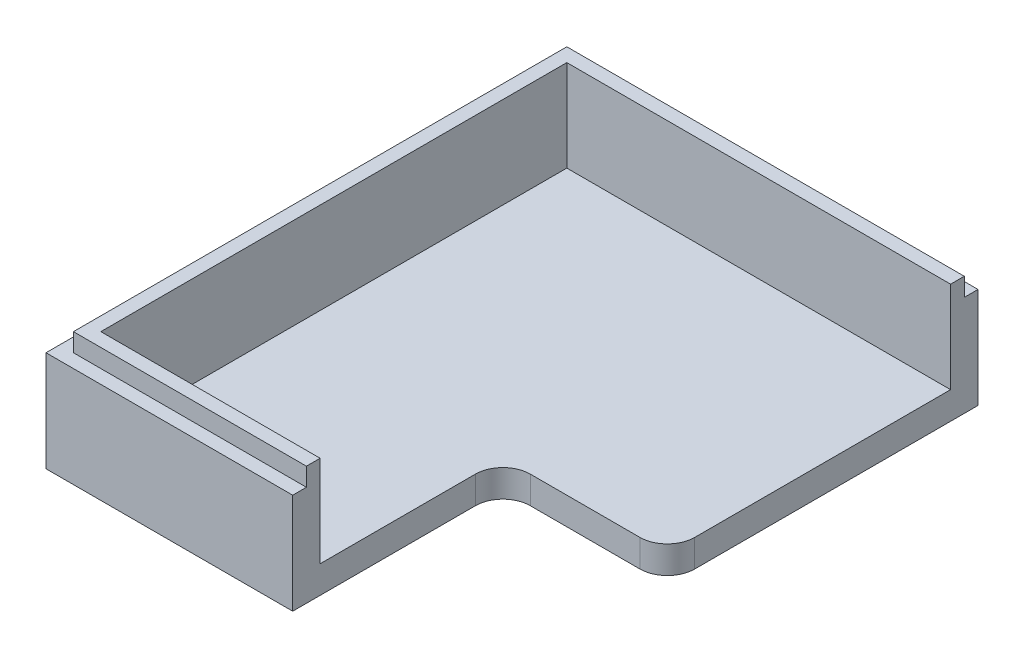
ISO-10303-21;
HEADER;
FILE_DESCRIPTION(('STEP AP214'),'2;1');
FILE_NAME('part.step','',(''),(''),'','','');
FILE_SCHEMA(('AUTOMOTIVE_DESIGN { 1 0 10303 214 1 1 1 1 }'));
ENDSEC;
DATA;
#1=APPLICATION_CONTEXT('core data for automotive mechanical design processes');
#2=APPLICATION_PROTOCOL_DEFINITION('international standard','automotive_design',2000,#1);
#3=PRODUCT_CONTEXT('',#1,'mechanical');
#4=PRODUCT('Part','Part','',(#3));
#5=PRODUCT_RELATED_PRODUCT_CATEGORY('part','',(#4));
#6=PRODUCT_DEFINITION_FORMATION('','',#4);
#7=PRODUCT_DEFINITION_CONTEXT('part definition',#1,'design');
#8=PRODUCT_DEFINITION('design','',#6,#7);
#9=PRODUCT_DEFINITION_SHAPE('','',#8);
#10=(LENGTH_UNIT() NAMED_UNIT(*) SI_UNIT(.MILLI.,.METRE.));
#11=(NAMED_UNIT(*) PLANE_ANGLE_UNIT() SI_UNIT($,.RADIAN.));
#12=(NAMED_UNIT(*) SI_UNIT($,.STERADIAN.) SOLID_ANGLE_UNIT());
#13=UNCERTAINTY_MEASURE_WITH_UNIT(LENGTH_MEASURE(1.E-05),#10,'distance_accuracy_value','');
#14=(GEOMETRIC_REPRESENTATION_CONTEXT(3) GLOBAL_UNCERTAINTY_ASSIGNED_CONTEXT((#13)) GLOBAL_UNIT_ASSIGNED_CONTEXT((#10,
#11,#12)) REPRESENTATION_CONTEXT('',''));
#15=CARTESIAN_POINT('',(0.,0.,0.));
#16=DIRECTION('',(0.,0.,1.));
#17=DIRECTION('',(1.,0.,0.));
#18=AXIS2_PLACEMENT_3D('',#15,#16,#17);
#19=CARTESIAN_POINT('',(0.,11.,0.));
#20=DIRECTION('',(0.,1.,0.));
#21=DIRECTION('',(0.,0.,1.));
#22=AXIS2_PLACEMENT_3D('',#19,#20,#21);
#23=PLANE('',#22);
#24=DIRECTION('',(0.,0.,1.));
#25=VECTOR('',#24,1.);
#26=CARTESIAN_POINT('',(-8.49999999999999,11.,0.));
#27=LINE('',#26,#25);
#28=CARTESIAN_POINT('',(-8.49999999999999,11.,27.));
#29=VERTEX_POINT('',#28);
#30=CARTESIAN_POINT('',(-8.49999999999999,11.,28.5));
#31=VERTEX_POINT('',#30);
#32=EDGE_CURVE('E154',#29,#31,#27,.T.);
#33=ORIENTED_EDGE('',*,*,#32,.F.);
#34=DIRECTION('',(1.,0.,0.));
#35=VECTOR('',#34,1.);
#36=CARTESIAN_POINT('',(-34.,11.,27.));
#37=LINE('',#36,#35);
#38=CARTESIAN_POINT('',(-34.,11.,27.));
#39=VERTEX_POINT('',#38);
#40=EDGE_CURVE('E239',#39,#29,#37,.T.);
#41=ORIENTED_EDGE('',*,*,#40,.F.);
#42=DIRECTION('',(0.,0.,1.));
#43=VECTOR('',#42,1.);
#44=CARTESIAN_POINT('',(-34.,11.,-27.));
#45=LINE('',#44,#43);
#46=CARTESIAN_POINT('',(-34.,11.,-27.));
#47=VERTEX_POINT('',#46);
#48=EDGE_CURVE('E246',#47,#39,#45,.T.);
#49=ORIENTED_EDGE('',*,*,#48,.F.);
#50=DIRECTION('',(-1.,0.,0.));
#51=VECTOR('',#50,1.);
#52=CARTESIAN_POINT('',(34.,11.,-27.));
#53=LINE('',#52,#51);
#54=CARTESIAN_POINT('',(9.50000000000001,11.,-27.));
#55=VERTEX_POINT('',#54);
#56=EDGE_CURVE('E235',#55,#47,#53,.T.);
#57=ORIENTED_EDGE('',*,*,#56,.F.);
#58=DIRECTION('',(0.,0.,1.));
#59=VECTOR('',#58,1.);
#60=CARTESIAN_POINT('',(9.50000000000001,11.,0.));
#61=LINE('',#60,#59);
#62=CARTESIAN_POINT('',(9.50000000000001,11.,-28.5));
#63=VERTEX_POINT('',#62);
#64=EDGE_CURVE('E224',#63,#55,#61,.T.);
#65=ORIENTED_EDGE('',*,*,#64,.F.);
#66=DIRECTION('',(-1.,0.,0.));
#67=VECTOR('',#66,1.);
#68=CARTESIAN_POINT('',(35.5,11.,-28.5));
#69=LINE('',#68,#67);
#70=CARTESIAN_POINT('',(-35.5,11.,-28.5));
#71=VERTEX_POINT('',#70);
#72=EDGE_CURVE('E268',#63,#71,#69,.T.);
#73=ORIENTED_EDGE('',*,*,#72,.T.);
#74=DIRECTION('',(0.,0.,1.));
#75=VECTOR('',#74,1.);
#76=CARTESIAN_POINT('',(-35.5,11.,-28.5));
#77=LINE('',#76,#75);
#78=CARTESIAN_POINT('',(-35.5,11.,28.5));
#79=VERTEX_POINT('',#78);
#80=EDGE_CURVE('E270',#71,#79,#77,.T.);
#81=ORIENTED_EDGE('',*,*,#80,.T.);
#82=DIRECTION('',(1.,0.,0.));
#83=VECTOR('',#82,1.);
#84=CARTESIAN_POINT('',(-35.5,11.,28.5));
#85=LINE('',#84,#83);
#86=EDGE_CURVE('E179',#79,#31,#85,.T.);
#87=ORIENTED_EDGE('',*,*,#86,.T.);
#88=EDGE_LOOP('',(#33,#41,#49,#57,#65,#73,#81,#87));
#89=FACE_BOUND('',#88,.T.);
#90=ADVANCED_FACE('F33',(#89),#23,.T.);
#91=CARTESIAN_POINT('',(-35.5,3.,-28.5));
#92=DIRECTION('',(1.,0.,0.));
#93=DIRECTION('',(0.,0.,-1.));
#94=AXIS2_PLACEMENT_3D('',#91,#92,#93);
#95=PLANE('',#94);
#96=DIRECTION('',(0.,0.,1.));
#97=VECTOR('',#96,1.);
#98=CARTESIAN_POINT('',(-35.5,0.,-28.5));
#99=LINE('',#98,#97);
#100=CARTESIAN_POINT('',(-35.5,0.,-28.5));
#101=VERTEX_POINT('',#100);
#102=CARTESIAN_POINT('',(-35.5,0.,28.5));
#103=VERTEX_POINT('',#102);
#104=EDGE_CURVE('E175',#101,#103,#99,.T.);
#105=ORIENTED_EDGE('',*,*,#104,.T.);
#106=DIRECTION('',(0.,-1.,0.));
#107=VECTOR('',#106,1.);
#108=CARTESIAN_POINT('',(-35.5,3.,28.5));
#109=LINE('',#108,#107);
#110=EDGE_CURVE('E172',#79,#103,#109,.T.);
#111=ORIENTED_EDGE('',*,*,#110,.F.);
#112=ORIENTED_EDGE('',*,*,#80,.F.);
#113=DIRECTION('',(0.,-1.,0.));
#114=VECTOR('',#113,1.);
#115=CARTESIAN_POINT('',(-35.5,3.,-28.5));
#116=LINE('',#115,#114);
#117=EDGE_CURVE('E177',#71,#101,#116,.T.);
#118=ORIENTED_EDGE('',*,*,#117,.T.);
#119=EDGE_LOOP('',(#105,#111,#112,#118));
#120=FACE_BOUND('',#119,.T.);
#121=ADVANCED_FACE('F279',(#120),#95,.F.);
#122=CARTESIAN_POINT('',(-35.5,3.,28.5));
#123=DIRECTION('',(0.,0.,-1.));
#124=DIRECTION('',(-1.,0.,0.));
#125=AXIS2_PLACEMENT_3D('',#122,#123,#124);
#126=PLANE('',#125);
#127=DIRECTION('',(1.,0.,0.));
#128=VECTOR('',#127,1.);
#129=CARTESIAN_POINT('',(-35.5,0.,28.5));
#130=LINE('',#129,#128);
#131=CARTESIAN_POINT('',(-8.49999999999999,0.,28.5));
#132=VERTEX_POINT('',#131);
#133=EDGE_CURVE('E166',#103,#132,#130,.T.);
#134=ORIENTED_EDGE('',*,*,#133,.T.);
#135=DIRECTION('',(0.,-1.,0.));
#136=VECTOR('',#135,1.);
#137=CARTESIAN_POINT('',(-8.49999999999999,13.,28.5));
#138=LINE('',#137,#136);
#139=EDGE_CURVE('E148',#31,#132,#138,.T.);
#140=ORIENTED_EDGE('',*,*,#139,.F.);
#141=ORIENTED_EDGE('',*,*,#86,.F.);
#142=ORIENTED_EDGE('',*,*,#110,.T.);
#143=EDGE_LOOP('',(#134,#140,#141,#142));
#144=FACE_BOUND('',#143,.T.);
#145=ADVANCED_FACE('F171',(#144),#126,.F.);
#146=CARTESIAN_POINT('',(-35.5,3.,-28.5));
#147=DIRECTION('',(0.,0.,1.));
#148=DIRECTION('',(1.,0.,0.));
#149=AXIS2_PLACEMENT_3D('',#146,#147,#148);
#150=PLANE('',#149);
#151=ORIENTED_EDGE('',*,*,#72,.F.);
#152=DIRECTION('',(0.,1.,0.));
#153=VECTOR('',#152,1.);
#154=CARTESIAN_POINT('',(9.50000000000001,14.9779468060906,-28.5));
#155=LINE('',#154,#153);
#156=CARTESIAN_POINT('',(9.50000000000001,0.,-28.5));
#157=VERTEX_POINT('',#156);
#158=EDGE_CURVE('E215',#157,#63,#155,.T.);
#159=ORIENTED_EDGE('',*,*,#158,.F.);
#160=DIRECTION('',(-1.,0.,0.));
#161=VECTOR('',#160,1.);
#162=CARTESIAN_POINT('',(-35.5,0.,-28.5));
#163=LINE('',#162,#161);
#164=EDGE_CURVE('E174',#157,#101,#163,.T.);
#165=ORIENTED_EDGE('',*,*,#164,.T.);
#166=ORIENTED_EDGE('',*,*,#117,.F.);
#167=EDGE_LOOP('',(#151,#159,#165,#166));
#168=FACE_BOUND('',#167,.T.);
#169=ADVANCED_FACE('F281',(#168),#150,.F.);
#170=CARTESIAN_POINT('',(0.,0.,0.));
#171=DIRECTION('',(0.,1.,0.));
#172=DIRECTION('',(0.,0.,1.));
#173=AXIS2_PLACEMENT_3D('',#170,#171,#172);
#174=PLANE('',#173);
#175=DIRECTION('',(0.,0.,1.));
#176=VECTOR('',#175,1.);
#177=CARTESIAN_POINT('',(9.50000000000001,0.,0.));
#178=LINE('',#177,#176);
#179=CARTESIAN_POINT('',(9.50000000000001,0.,2.5));
#180=VERTEX_POINT('',#179);
#181=EDGE_CURVE('E202',#157,#180,#178,.T.);
#182=ORIENTED_EDGE('',*,*,#181,.T.);
#183=CARTESIAN_POINT('',(6.50000000000001,0.,2.5));
#184=DIRECTION('',(0.,1.,0.));
#185=DIRECTION('',(0.,0.,1.));
#186=AXIS2_PLACEMENT_3D('',#183,#184,#185);
#187=CIRCLE('',#186,3.);
#188=CARTESIAN_POINT('',(6.50000000000001,0.,5.5));
#189=VERTEX_POINT('',#188);
#190=EDGE_CURVE('E48',#180,#189,#187,.F.);
#191=ORIENTED_EDGE('',*,*,#190,.T.);
#192=DIRECTION('',(1.,0.,0.));
#193=VECTOR('',#192,1.);
#194=CARTESIAN_POINT('',(35.5,0.,5.50000000000001));
#195=LINE('',#194,#193);
#196=CARTESIAN_POINT('',(-5.49999999999998,0.,5.5));
#197=VERTEX_POINT('',#196);
#198=EDGE_CURVE('E169',#197,#189,#195,.T.);
#199=ORIENTED_EDGE('',*,*,#198,.F.);
#200=CARTESIAN_POINT('',(-5.49999999999998,0.,8.5));
#201=DIRECTION('',(0.,1.,0.));
#202=DIRECTION('',(0.,0.,1.));
#203=AXIS2_PLACEMENT_3D('',#200,#201,#202);
#204=CIRCLE('',#203,3.);
#205=CARTESIAN_POINT('',(-8.49999999999999,0.,8.5));
#206=VERTEX_POINT('',#205);
#207=EDGE_CURVE('E41',#197,#206,#204,.T.);
#208=ORIENTED_EDGE('',*,*,#207,.T.);
#209=DIRECTION('',(0.,0.,-1.));
#210=VECTOR('',#209,1.);
#211=CARTESIAN_POINT('',(-8.49999999999999,0.,28.5));
#212=LINE('',#211,#210);
#213=EDGE_CURVE('E151',#132,#206,#212,.T.);
#214=ORIENTED_EDGE('',*,*,#213,.F.);
#215=ORIENTED_EDGE('',*,*,#133,.F.);
#216=ORIENTED_EDGE('',*,*,#104,.F.);
#217=ORIENTED_EDGE('',*,*,#164,.F.);
#218=EDGE_LOOP('',(#182,#191,#199,#208,#214,#215,#216,#217));
#219=FACE_BOUND('',#218,.T.);
#220=ADVANCED_FACE('F164',(#219),#174,.F.);
#221=CARTESIAN_POINT('',(0.,13.,0.));
#222=DIRECTION('',(0.,1.,0.));
#223=DIRECTION('',(0.,0.,1.));
#224=AXIS2_PLACEMENT_3D('',#221,#222,#223);
#225=PLANE('',#224);
#226=DIRECTION('',(0.,0.,-1.));
#227=VECTOR('',#226,1.);
#228=CARTESIAN_POINT('',(-8.49999999999999,13.,28.5));
#229=LINE('',#228,#227);
#230=CARTESIAN_POINT('',(-8.49999999999999,13.,27.));
#231=VERTEX_POINT('',#230);
#232=CARTESIAN_POINT('',(-8.49999999999999,13.,25.5));
#233=VERTEX_POINT('',#232);
#234=EDGE_CURVE('E160',#231,#233,#229,.T.);
#235=ORIENTED_EDGE('',*,*,#234,.T.);
#236=DIRECTION('',(1.,0.,0.));
#237=VECTOR('',#236,1.);
#238=CARTESIAN_POINT('',(-32.5,13.,25.5));
#239=LINE('',#238,#237);
#240=CARTESIAN_POINT('',(-32.5,13.,25.5));
#241=VERTEX_POINT('',#240);
#242=EDGE_CURVE('E227',#241,#233,#239,.T.);
#243=ORIENTED_EDGE('',*,*,#242,.F.);
#244=DIRECTION('',(0.,0.,1.));
#245=VECTOR('',#244,1.);
#246=CARTESIAN_POINT('',(-32.5,13.,-25.5));
#247=LINE('',#246,#245);
#248=CARTESIAN_POINT('',(-32.5,13.,-25.5));
#249=VERTEX_POINT('',#248);
#250=EDGE_CURVE('E232',#249,#241,#247,.T.);
#251=ORIENTED_EDGE('',*,*,#250,.F.);
#252=DIRECTION('',(-1.,0.,0.));
#253=VECTOR('',#252,1.);
#254=CARTESIAN_POINT('',(32.5,13.,-25.5));
#255=LINE('',#254,#253);
#256=CARTESIAN_POINT('',(9.50000000000001,13.,-25.5));
#257=VERTEX_POINT('',#256);
#258=EDGE_CURVE('E230',#257,#249,#255,.T.);
#259=ORIENTED_EDGE('',*,*,#258,.F.);
#260=DIRECTION('',(0.,0.,1.));
#261=VECTOR('',#260,1.);
#262=CARTESIAN_POINT('',(9.50000000000001,13.,0.));
#263=LINE('',#262,#261);
#264=CARTESIAN_POINT('',(9.50000000000001,13.,-27.));
#265=VERTEX_POINT('',#264);
#266=EDGE_CURVE('E214',#265,#257,#263,.T.);
#267=ORIENTED_EDGE('',*,*,#266,.F.);
#268=DIRECTION('',(-1.,0.,0.));
#269=VECTOR('',#268,1.);
#270=CARTESIAN_POINT('',(34.,13.,-27.));
#271=LINE('',#270,#269);
#272=CARTESIAN_POINT('',(-34.,13.,-27.));
#273=VERTEX_POINT('',#272);
#274=EDGE_CURVE('E236',#265,#273,#271,.T.);
#275=ORIENTED_EDGE('',*,*,#274,.T.);
#276=DIRECTION('',(0.,0.,1.));
#277=VECTOR('',#276,1.);
#278=CARTESIAN_POINT('',(-34.,13.,-27.));
#279=LINE('',#278,#277);
#280=CARTESIAN_POINT('',(-34.,13.,27.));
#281=VERTEX_POINT('',#280);
#282=EDGE_CURVE('E238',#273,#281,#279,.T.);
#283=ORIENTED_EDGE('',*,*,#282,.T.);
#284=DIRECTION('',(1.,0.,0.));
#285=VECTOR('',#284,1.);
#286=CARTESIAN_POINT('',(-34.,13.,27.));
#287=LINE('',#286,#285);
#288=EDGE_CURVE('E241',#281,#231,#287,.T.);
#289=ORIENTED_EDGE('',*,*,#288,.T.);
#290=EDGE_LOOP('',(#235,#243,#251,#259,#267,#275,#283,#289));
#291=FACE_BOUND('',#290,.T.);
#292=ADVANCED_FACE('F295',(#291),#225,.T.);
#293=CARTESIAN_POINT('',(34.,13.,-27.));
#294=DIRECTION('',(0.,0.,1.));
#295=DIRECTION('',(1.,0.,0.));
#296=AXIS2_PLACEMENT_3D('',#293,#294,#295);
#297=PLANE('',#296);
#298=ORIENTED_EDGE('',*,*,#274,.F.);
#299=DIRECTION('',(0.,-1.,0.));
#300=VECTOR('',#299,1.);
#301=CARTESIAN_POINT('',(9.50000000000001,13.,-27.));
#302=LINE('',#301,#300);
#303=EDGE_CURVE('E217',#265,#55,#302,.T.);
#304=ORIENTED_EDGE('',*,*,#303,.T.);
#305=ORIENTED_EDGE('',*,*,#56,.T.);
#306=DIRECTION('',(0.,-1.,0.));
#307=VECTOR('',#306,1.);
#308=CARTESIAN_POINT('',(-34.,13.,-27.));
#309=LINE('',#308,#307);
#310=EDGE_CURVE('E252',#273,#47,#309,.T.);
#311=ORIENTED_EDGE('',*,*,#310,.F.);
#312=EDGE_LOOP('',(#298,#304,#305,#311));
#313=FACE_BOUND('',#312,.T.);
#314=ADVANCED_FACE('F287',(#313),#297,.F.);
#315=CARTESIAN_POINT('',(-34.,13.,-27.));
#316=DIRECTION('',(1.,0.,0.));
#317=DIRECTION('',(0.,0.,-1.));
#318=AXIS2_PLACEMENT_3D('',#315,#316,#317);
#319=PLANE('',#318);
#320=ORIENTED_EDGE('',*,*,#48,.T.);
#321=DIRECTION('',(0.,-1.,0.));
#322=VECTOR('',#321,1.);
#323=CARTESIAN_POINT('',(-34.,13.,27.));
#324=LINE('',#323,#322);
#325=EDGE_CURVE('E244',#281,#39,#324,.T.);
#326=ORIENTED_EDGE('',*,*,#325,.F.);
#327=ORIENTED_EDGE('',*,*,#282,.F.);
#328=ORIENTED_EDGE('',*,*,#310,.T.);
#329=EDGE_LOOP('',(#320,#326,#327,#328));
#330=FACE_BOUND('',#329,.T.);
#331=ADVANCED_FACE('F290',(#330),#319,.F.);
#332=CARTESIAN_POINT('',(-34.,13.,27.));
#333=DIRECTION('',(0.,0.,-1.));
#334=DIRECTION('',(-1.,0.,0.));
#335=AXIS2_PLACEMENT_3D('',#332,#333,#334);
#336=PLANE('',#335);
#337=ORIENTED_EDGE('',*,*,#40,.T.);
#338=DIRECTION('',(0.,1.,0.));
#339=VECTOR('',#338,1.);
#340=CARTESIAN_POINT('',(-8.49999999999999,13.,27.));
#341=LINE('',#340,#339);
#342=EDGE_CURVE('E314',#29,#231,#341,.T.);
#343=ORIENTED_EDGE('',*,*,#342,.T.);
#344=ORIENTED_EDGE('',*,*,#288,.F.);
#345=ORIENTED_EDGE('',*,*,#325,.T.);
#346=EDGE_LOOP('',(#337,#343,#344,#345));
#347=FACE_BOUND('',#346,.T.);
#348=ADVANCED_FACE('F335',(#347),#336,.F.);
#349=CARTESIAN_POINT('',(0.,3.,0.));
#350=DIRECTION('',(0.,1.,0.));
#351=DIRECTION('',(0.,0.,1.));
#352=AXIS2_PLACEMENT_3D('',#349,#350,#351);
#353=PLANE('',#352);
#354=DIRECTION('',(-1.,0.,0.));
#355=VECTOR('',#354,1.);
#356=CARTESIAN_POINT('',(0.,3.,5.5));
#357=LINE('',#356,#355);
#358=CARTESIAN_POINT('',(6.50000000000001,3.,5.5));
#359=VERTEX_POINT('',#358);
#360=CARTESIAN_POINT('',(-5.49999999999998,3.,5.5));
#361=VERTEX_POINT('',#360);
#362=EDGE_CURVE('E159',#359,#361,#357,.T.);
#363=ORIENTED_EDGE('',*,*,#362,.F.);
#364=CARTESIAN_POINT('',(6.50000000000001,3.,2.5));
#365=DIRECTION('',(0.,1.,0.));
#366=DIRECTION('',(0.,0.,1.));
#367=AXIS2_PLACEMENT_3D('',#364,#365,#366);
#368=CIRCLE('',#367,3.);
#369=CARTESIAN_POINT('',(9.50000000000001,3.,2.5));
#370=VERTEX_POINT('',#369);
#371=EDGE_CURVE('E56',#359,#370,#368,.T.);
#372=ORIENTED_EDGE('',*,*,#371,.T.);
#373=DIRECTION('',(0.,0.,1.));
#374=VECTOR('',#373,1.);
#375=CARTESIAN_POINT('',(9.50000000000001,3.,0.));
#376=LINE('',#375,#374);
#377=CARTESIAN_POINT('',(9.50000000000001,3.,-25.5));
#378=VERTEX_POINT('',#377);
#379=EDGE_CURVE('E211',#378,#370,#376,.T.);
#380=ORIENTED_EDGE('',*,*,#379,.F.);
#381=DIRECTION('',(-1.,0.,0.));
#382=VECTOR('',#381,1.);
#383=CARTESIAN_POINT('',(32.5,3.,-25.5));
#384=LINE('',#383,#382);
#385=CARTESIAN_POINT('',(-32.5,3.,-25.5));
#386=VERTEX_POINT('',#385);
#387=EDGE_CURVE('E255',#378,#386,#384,.T.);
#388=ORIENTED_EDGE('',*,*,#387,.T.);
#389=DIRECTION('',(0.,0.,1.));
#390=VECTOR('',#389,1.);
#391=CARTESIAN_POINT('',(-32.5,3.,-25.5));
#392=LINE('',#391,#390);
#393=CARTESIAN_POINT('',(-32.5,3.,25.5));
#394=VERTEX_POINT('',#393);
#395=EDGE_CURVE('E257',#386,#394,#392,.T.);
#396=ORIENTED_EDGE('',*,*,#395,.T.);
#397=DIRECTION('',(1.,0.,0.));
#398=VECTOR('',#397,1.);
#399=CARTESIAN_POINT('',(-32.5,3.,25.5));
#400=LINE('',#399,#398);
#401=CARTESIAN_POINT('',(-8.49999999999999,3.,25.5));
#402=VERTEX_POINT('',#401);
#403=EDGE_CURVE('E259',#394,#402,#400,.T.);
#404=ORIENTED_EDGE('',*,*,#403,.T.);
#405=DIRECTION('',(0.,0.,1.));
#406=VECTOR('',#405,1.);
#407=CARTESIAN_POINT('',(-8.49999999999999,3.,0.));
#408=LINE('',#407,#406);
#409=CARTESIAN_POINT('',(-8.49999999999999,3.,8.5));
#410=VERTEX_POINT('',#409);
#411=EDGE_CURVE('E312',#410,#402,#408,.T.);
#412=ORIENTED_EDGE('',*,*,#411,.F.);
#413=CARTESIAN_POINT('',(-5.49999999999998,3.,8.5));
#414=DIRECTION('',(0.,1.,0.));
#415=DIRECTION('',(0.,0.,1.));
#416=AXIS2_PLACEMENT_3D('',#413,#414,#415);
#417=CIRCLE('',#416,3.);
#418=EDGE_CURVE('E11',#410,#361,#417,.F.);
#419=ORIENTED_EDGE('',*,*,#418,.T.);
#420=EDGE_LOOP('',(#363,#372,#380,#388,#396,#404,#412,#419));
#421=FACE_BOUND('',#420,.T.);
#422=ADVANCED_FACE('F303',(#421),#353,.T.);
#423=CARTESIAN_POINT('',(-32.5,11.,25.5));
#424=DIRECTION('',(0.,0.,-1.));
#425=DIRECTION('',(-1.,0.,0.));
#426=AXIS2_PLACEMENT_3D('',#423,#424,#425);
#427=PLANE('',#426);
#428=DIRECTION('',(0.,1.,0.));
#429=VECTOR('',#428,1.);
#430=CARTESIAN_POINT('',(-8.49999999999999,11.,25.5));
#431=LINE('',#430,#429);
#432=EDGE_CURVE('E188',#402,#233,#431,.T.);
#433=ORIENTED_EDGE('',*,*,#432,.F.);
#434=ORIENTED_EDGE('',*,*,#403,.F.);
#435=DIRECTION('',(0.,-1.,0.));
#436=VECTOR('',#435,1.);
#437=CARTESIAN_POINT('',(-32.5,11.,25.5));
#438=LINE('',#437,#436);
#439=EDGE_CURVE('E262',#241,#394,#438,.T.);
#440=ORIENTED_EDGE('',*,*,#439,.F.);
#441=ORIENTED_EDGE('',*,*,#242,.T.);
#442=EDGE_LOOP('',(#433,#434,#440,#441));
#443=FACE_BOUND('',#442,.T.);
#444=ADVANCED_FACE('F310',(#443),#427,.T.);
#445=CARTESIAN_POINT('',(-32.5,11.,-25.5));
#446=DIRECTION('',(1.,0.,0.));
#447=DIRECTION('',(0.,0.,-1.));
#448=AXIS2_PLACEMENT_3D('',#445,#446,#447);
#449=PLANE('',#448);
#450=ORIENTED_EDGE('',*,*,#395,.F.);
#451=DIRECTION('',(0.,-1.,0.));
#452=VECTOR('',#451,1.);
#453=CARTESIAN_POINT('',(-32.5,11.,-25.5));
#454=LINE('',#453,#452);
#455=EDGE_CURVE('E265',#249,#386,#454,.T.);
#456=ORIENTED_EDGE('',*,*,#455,.F.);
#457=ORIENTED_EDGE('',*,*,#250,.T.);
#458=ORIENTED_EDGE('',*,*,#439,.T.);
#459=EDGE_LOOP('',(#450,#456,#457,#458));
#460=FACE_BOUND('',#459,.T.);
#461=ADVANCED_FACE('F305',(#460),#449,.T.);
#462=CARTESIAN_POINT('',(32.5,11.,-25.5));
#463=DIRECTION('',(0.,0.,1.));
#464=DIRECTION('',(1.,0.,0.));
#465=AXIS2_PLACEMENT_3D('',#462,#463,#464);
#466=PLANE('',#465);
#467=DIRECTION('',(0.,-1.,0.));
#468=VECTOR('',#467,1.);
#469=CARTESIAN_POINT('',(9.50000000000001,11.,-25.5));
#470=LINE('',#469,#468);
#471=EDGE_CURVE('E186',#257,#378,#470,.T.);
#472=ORIENTED_EDGE('',*,*,#471,.F.);
#473=ORIENTED_EDGE('',*,*,#258,.T.);
#474=ORIENTED_EDGE('',*,*,#455,.T.);
#475=ORIENTED_EDGE('',*,*,#387,.F.);
#476=EDGE_LOOP('',(#472,#473,#474,#475));
#477=FACE_BOUND('',#476,.T.);
#478=ADVANCED_FACE('F300',(#477),#466,.T.);
#479=CARTESIAN_POINT('',(9.50000000000001,14.9779468060906,28.5));
#480=DIRECTION('',(-1.,0.,0.));
#481=DIRECTION('',(0.,-1.,0.));
#482=AXIS2_PLACEMENT_3D('',#479,#480,#481);
#483=PLANE('',#482);
#484=ORIENTED_EDGE('',*,*,#379,.T.);
#485=DIRECTION('',(0.,-1.,0.));
#486=VECTOR('',#485,1.);
#487=CARTESIAN_POINT('',(9.50000000000001,14.9779468060906,2.5));
#488=LINE('',#487,#486);
#489=EDGE_CURVE('E197',#370,#180,#488,.T.);
#490=ORIENTED_EDGE('',*,*,#489,.T.);
#491=ORIENTED_EDGE('',*,*,#181,.F.);
#492=ORIENTED_EDGE('',*,*,#158,.T.);
#493=ORIENTED_EDGE('',*,*,#64,.T.);
#494=ORIENTED_EDGE('',*,*,#303,.F.);
#495=ORIENTED_EDGE('',*,*,#266,.T.);
#496=ORIENTED_EDGE('',*,*,#471,.T.);
#497=EDGE_LOOP('',(#484,#490,#491,#492,#493,#494,#495,#496));
#498=FACE_BOUND('',#497,.T.);
#499=ADVANCED_FACE('F209',(#498),#483,.F.);
#500=CARTESIAN_POINT('',(35.5,13.,5.50000000000001));
#501=DIRECTION('',(0.,0.,-1.));
#502=DIRECTION('',(-1.,0.,0.));
#503=AXIS2_PLACEMENT_3D('',#500,#501,#502);
#504=PLANE('',#503);
#505=ORIENTED_EDGE('',*,*,#362,.T.);
#506=DIRECTION('',(0.,-1.,0.));
#507=VECTOR('',#506,1.);
#508=CARTESIAN_POINT('',(-5.49999999999998,0.,5.5));
#509=LINE('',#508,#507);
#510=EDGE_CURVE('E192',#361,#197,#509,.T.);
#511=ORIENTED_EDGE('',*,*,#510,.T.);
#512=ORIENTED_EDGE('',*,*,#198,.T.);
#513=DIRECTION('',(0.,-1.,0.));
#514=VECTOR('',#513,1.);
#515=CARTESIAN_POINT('',(6.50000000000001,13.,5.5));
#516=LINE('',#515,#514);
#517=EDGE_CURVE('E190',#189,#359,#516,.F.);
#518=ORIENTED_EDGE('',*,*,#517,.T.);
#519=EDGE_LOOP('',(#505,#511,#512,#518));
#520=FACE_BOUND('',#519,.T.);
#521=ADVANCED_FACE('F205',(#520),#504,.F.);
#522=CARTESIAN_POINT('',(-8.49999999999999,13.,28.5));
#523=DIRECTION('',(-1.,0.,0.));
#524=DIRECTION('',(0.,0.,1.));
#525=AXIS2_PLACEMENT_3D('',#522,#523,#524);
#526=PLANE('',#525);
#527=ORIENTED_EDGE('',*,*,#213,.T.);
#528=DIRECTION('',(0.,-1.,0.));
#529=VECTOR('',#528,1.);
#530=CARTESIAN_POINT('',(-8.49999999999999,3.,8.5));
#531=LINE('',#530,#529);
#532=EDGE_CURVE('E195',#206,#410,#531,.F.);
#533=ORIENTED_EDGE('',*,*,#532,.T.);
#534=ORIENTED_EDGE('',*,*,#411,.T.);
#535=ORIENTED_EDGE('',*,*,#432,.T.);
#536=ORIENTED_EDGE('',*,*,#234,.F.);
#537=ORIENTED_EDGE('',*,*,#342,.F.);
#538=ORIENTED_EDGE('',*,*,#32,.T.);
#539=ORIENTED_EDGE('',*,*,#139,.T.);
#540=EDGE_LOOP('',(#527,#533,#534,#535,#536,#537,#538,#539));
#541=FACE_BOUND('',#540,.T.);
#542=ADVANCED_FACE('F150',(#541),#526,.F.);
#543=CARTESIAN_POINT('',(-5.49999999999998,13.,8.5));
#544=DIRECTION('',(0.,1.,0.));
#545=DIRECTION('',(0.,0.,1.));
#546=AXIS2_PLACEMENT_3D('',#543,#544,#545);
#547=CYLINDRICAL_SURFACE('',#546,3.);
#548=ORIENTED_EDGE('',*,*,#418,.F.);
#549=ORIENTED_EDGE('',*,*,#532,.F.);
#550=ORIENTED_EDGE('',*,*,#207,.F.);
#551=ORIENTED_EDGE('',*,*,#510,.F.);
#552=EDGE_LOOP('',(#548,#549,#550,#551));
#553=FACE_BOUND('',#552,.T.);
#554=ADVANCED_FACE('F317',(#553),#547,.F.);
#555=CARTESIAN_POINT('',(6.50000000000001,14.9779468060906,2.5));
#556=DIRECTION('',(0.,-1.,0.));
#557=DIRECTION('',(1.,0.,0.));
#558=AXIS2_PLACEMENT_3D('',#555,#556,#557);
#559=CYLINDRICAL_SURFACE('',#558,3.);
#560=ORIENTED_EDGE('',*,*,#371,.F.);
#561=ORIENTED_EDGE('',*,*,#517,.F.);
#562=ORIENTED_EDGE('',*,*,#190,.F.);
#563=ORIENTED_EDGE('',*,*,#489,.F.);
#564=EDGE_LOOP('',(#560,#561,#562,#563));
#565=FACE_BOUND('',#564,.T.);
#566=ADVANCED_FACE('F35',(#565),#559,.T.);
#567=CLOSED_SHELL('',(#90,#121,#145,#169,#220,#292,#314,#331,#348,#422,#444,#461,#478,#499,#521,
#542,#554,#566));
#568=MANIFOLD_SOLID_BREP('B2',#567);
#569=ADVANCED_BREP_SHAPE_REPRESENTATION('',(#18,#568),#14);
#570=SHAPE_DEFINITION_REPRESENTATION(#9,#569);
ENDSEC;
END-ISO-10303-21;
